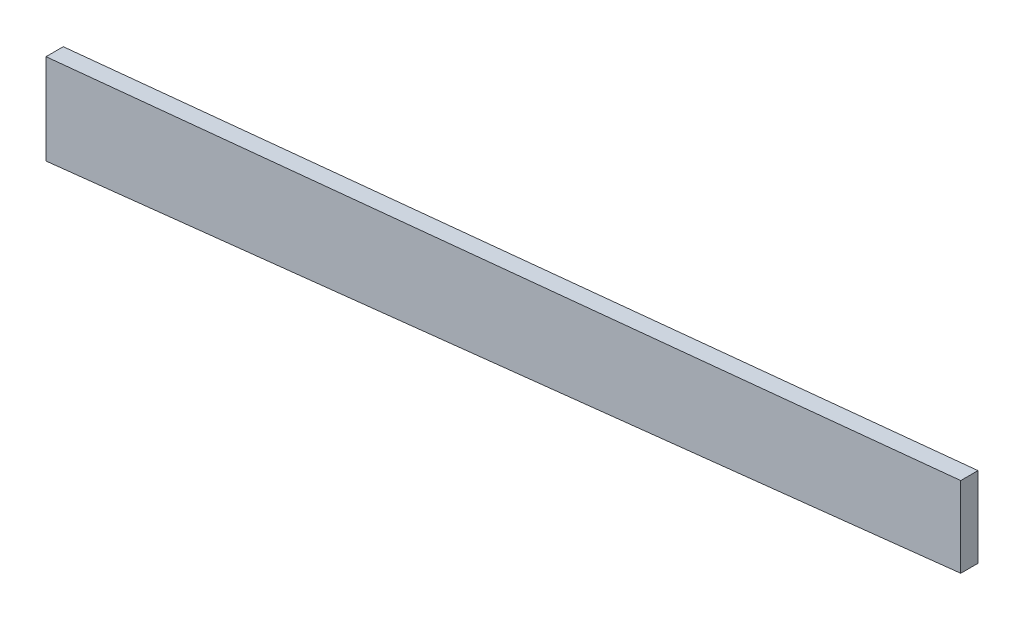
ISO-10303-21;
HEADER;
FILE_DESCRIPTION(('STEP AP214'),'2;1');
FILE_NAME('part.step','',(''),(''),'','','');
FILE_SCHEMA(('AUTOMOTIVE_DESIGN { 1 0 10303 214 1 1 1 1 }'));
ENDSEC;
DATA;
#1=APPLICATION_CONTEXT('core data for automotive mechanical design processes');
#2=APPLICATION_PROTOCOL_DEFINITION('international standard','automotive_design',2000,#1);
#3=PRODUCT_CONTEXT('',#1,'mechanical');
#4=PRODUCT('Part','Part','',(#3));
#5=PRODUCT_RELATED_PRODUCT_CATEGORY('part','',(#4));
#6=PRODUCT_DEFINITION_FORMATION('','',#4);
#7=PRODUCT_DEFINITION_CONTEXT('part definition',#1,'design');
#8=PRODUCT_DEFINITION('design','',#6,#7);
#9=PRODUCT_DEFINITION_SHAPE('','',#8);
#10=(LENGTH_UNIT() NAMED_UNIT(*) SI_UNIT(.MILLI.,.METRE.));
#11=(NAMED_UNIT(*) PLANE_ANGLE_UNIT() SI_UNIT($,.RADIAN.));
#12=(NAMED_UNIT(*) SI_UNIT($,.STERADIAN.) SOLID_ANGLE_UNIT());
#13=UNCERTAINTY_MEASURE_WITH_UNIT(LENGTH_MEASURE(1.E-05),#10,'distance_accuracy_value','');
#14=(GEOMETRIC_REPRESENTATION_CONTEXT(3) GLOBAL_UNCERTAINTY_ASSIGNED_CONTEXT((#13)) GLOBAL_UNIT_ASSIGNED_CONTEXT((#10,
#11,#12)) REPRESENTATION_CONTEXT('',''));
#15=CARTESIAN_POINT('',(0.,0.,0.));
#16=DIRECTION('',(0.,0.,1.));
#17=DIRECTION('',(1.,0.,0.));
#18=AXIS2_PLACEMENT_3D('',#15,#16,#17);
#19=CARTESIAN_POINT('',(-169.8625,0.,-3.175));
#20=DIRECTION('',(1.,0.,0.));
#21=DIRECTION('',(0.,0.,-1.));
#22=AXIS2_PLACEMENT_3D('',#19,#20,#21);
#23=PLANE('',#22);
#24=DIRECTION('',(0.,1.,0.));
#25=VECTOR('',#24,1.);
#26=CARTESIAN_POINT('',(-169.8625,0.,0.));
#27=LINE('',#26,#25);
#28=CARTESIAN_POINT('',(-169.8625,105.89060870458,0.));
#29=VERTEX_POINT('',#28);
#30=CARTESIAN_POINT('',(-169.8625,122.519845253023,0.));
#31=VERTEX_POINT('',#30);
#32=EDGE_CURVE('E102',#29,#31,#27,.T.);
#33=ORIENTED_EDGE('',*,*,#32,.T.);
#34=DIRECTION('',(0.,0.,1.));
#35=VECTOR('',#34,1.);
#36=CARTESIAN_POINT('',(-169.8625,122.519845253023,-3.175));
#37=LINE('',#36,#35);
#38=CARTESIAN_POINT('',(-169.8625,122.519845253023,-3.175));
#39=VERTEX_POINT('',#38);
#40=EDGE_CURVE('E11',#39,#31,#37,.T.);
#41=ORIENTED_EDGE('',*,*,#40,.F.);
#42=DIRECTION('',(0.,1.,0.));
#43=VECTOR('',#42,1.);
#44=CARTESIAN_POINT('',(-169.8625,0.,-3.175));
#45=LINE('',#44,#43);
#46=CARTESIAN_POINT('',(-169.8625,105.89060870458,-3.175));
#47=VERTEX_POINT('',#46);
#48=EDGE_CURVE('E57',#47,#39,#45,.T.);
#49=ORIENTED_EDGE('',*,*,#48,.F.);
#50=DIRECTION('',(0.,0.,1.));
#51=VECTOR('',#50,1.);
#52=CARTESIAN_POINT('',(-169.8625,105.89060870458,-3.175));
#53=LINE('',#52,#51);
#54=EDGE_CURVE('E42',#47,#29,#53,.T.);
#55=ORIENTED_EDGE('',*,*,#54,.T.);
#56=EDGE_LOOP('',(#33,#41,#49,#55));
#57=FACE_BOUND('',#56,.T.);
#58=ADVANCED_FACE('F39',(#57),#23,.F.);
#59=CARTESIAN_POINT('',(-13.6134957947172,137.940254406463,-3.175));
#60=DIRECTION('',(-0.0982141057246824,0.995165307593015,0.));
#61=DIRECTION('',(-0.995165307593016,-0.0982141057246824,0.));
#62=AXIS2_PLACEMENT_3D('',#59,#60,#61);
#63=PLANE('',#62);
#64=DIRECTION('',(-0.995165307593016,-0.0982141057246824,0.));
#65=VECTOR('',#64,1.);
#66=CARTESIAN_POINT('',(-13.6134957947172,137.940254406463,0.));
#67=LINE('',#66,#65);
#68=CARTESIAN_POINT('',(-1.5875,139.127114934473,0.));
#69=VERTEX_POINT('',#68);
#70=EDGE_CURVE('E98',#69,#31,#67,.T.);
#71=ORIENTED_EDGE('',*,*,#70,.F.);
#72=DIRECTION('',(0.,0.,1.));
#73=VECTOR('',#72,1.);
#74=CARTESIAN_POINT('',(-1.5875,139.127114934473,-3.175));
#75=LINE('',#74,#73);
#76=CARTESIAN_POINT('',(-1.5875,139.127114934473,-3.175));
#77=VERTEX_POINT('',#76);
#78=EDGE_CURVE('E48',#77,#69,#75,.T.);
#79=ORIENTED_EDGE('',*,*,#78,.F.);
#80=DIRECTION('',(-0.995165307593016,-0.0982141057246824,0.));
#81=VECTOR('',#80,1.);
#82=CARTESIAN_POINT('',(-13.6134957947172,137.940254406463,-3.175));
#83=LINE('',#82,#81);
#84=EDGE_CURVE('E87',#77,#39,#83,.T.);
#85=ORIENTED_EDGE('',*,*,#84,.T.);
#86=ORIENTED_EDGE('',*,*,#40,.T.);
#87=EDGE_LOOP('',(#71,#79,#85,#86));
#88=FACE_BOUND('',#87,.T.);
#89=ADVANCED_FACE('F112',(#88),#63,.T.);
#90=CARTESIAN_POINT('',(-1.5875,0.,-3.175));
#91=DIRECTION('',(-1.,0.,0.));
#92=DIRECTION('',(0.,-1.,0.));
#93=AXIS2_PLACEMENT_3D('',#90,#91,#92);
#94=PLANE('',#93);
#95=DIRECTION('',(0.,-1.,0.));
#96=VECTOR('',#95,1.);
#97=CARTESIAN_POINT('',(-1.5875,0.,0.));
#98=LINE('',#97,#96);
#99=CARTESIAN_POINT('',(-1.5875,124.350207240757,0.));
#100=VERTEX_POINT('',#99);
#101=EDGE_CURVE('E92',#69,#100,#98,.T.);
#102=ORIENTED_EDGE('',*,*,#101,.T.);
#103=DIRECTION('',(0.,0.,1.));
#104=VECTOR('',#103,1.);
#105=CARTESIAN_POINT('',(-1.5875,124.350207240757,-3.175));
#106=LINE('',#105,#104);
#107=CARTESIAN_POINT('',(-1.5875,124.350207240757,-3.175));
#108=VERTEX_POINT('',#107);
#109=EDGE_CURVE('E90',#108,#100,#106,.T.);
#110=ORIENTED_EDGE('',*,*,#109,.F.);
#111=DIRECTION('',(0.,-1.,0.));
#112=VECTOR('',#111,1.);
#113=CARTESIAN_POINT('',(-1.5875,0.,-3.175));
#114=LINE('',#113,#112);
#115=EDGE_CURVE('E84',#77,#108,#114,.T.);
#116=ORIENTED_EDGE('',*,*,#115,.F.);
#117=ORIENTED_EDGE('',*,*,#78,.T.);
#118=EDGE_LOOP('',(#102,#110,#116,#117));
#119=FACE_BOUND('',#118,.T.);
#120=ADVANCED_FACE('F91',(#119),#94,.F.);
#121=CARTESIAN_POINT('',(-13.4977662825132,123.043662988585,-3.175));
#122=DIRECTION('',(-0.109044842308986,0.994036831493586,0.));
#123=DIRECTION('',(-0.994036831493586,-0.109044842308986,0.));
#124=AXIS2_PLACEMENT_3D('',#121,#122,#123);
#125=PLANE('',#124);
#126=DIRECTION('',(-0.994036831493586,-0.109044842308986,0.));
#127=VECTOR('',#126,1.);
#128=CARTESIAN_POINT('',(-13.4977662825132,123.043662988585,0.));
#129=LINE('',#128,#127);
#130=EDGE_CURVE('E104',#100,#29,#129,.T.);
#131=ORIENTED_EDGE('',*,*,#130,.T.);
#132=ORIENTED_EDGE('',*,*,#54,.F.);
#133=DIRECTION('',(-0.994036831493586,-0.109044842308986,0.));
#134=VECTOR('',#133,1.);
#135=CARTESIAN_POINT('',(-13.4977662825132,123.043662988585,-3.175));
#136=LINE('',#135,#134);
#137=EDGE_CURVE('E82',#108,#47,#136,.T.);
#138=ORIENTED_EDGE('',*,*,#137,.F.);
#139=ORIENTED_EDGE('',*,*,#109,.T.);
#140=EDGE_LOOP('',(#131,#132,#138,#139));
#141=FACE_BOUND('',#140,.T.);
#142=ADVANCED_FACE('F95',(#141),#125,.F.);
#143=CARTESIAN_POINT('',(0.,0.,-3.175));
#144=DIRECTION('',(0.,0.,1.));
#145=DIRECTION('',(1.,0.,0.));
#146=AXIS2_PLACEMENT_3D('',#143,#144,#145);
#147=PLANE('',#146);
#148=ORIENTED_EDGE('',*,*,#48,.T.);
#149=ORIENTED_EDGE('',*,*,#84,.F.);
#150=ORIENTED_EDGE('',*,*,#115,.T.);
#151=ORIENTED_EDGE('',*,*,#137,.T.);
#152=EDGE_LOOP('',(#148,#149,#150,#151));
#153=FACE_BOUND('',#152,.T.);
#154=ADVANCED_FACE('F86',(#153),#147,.F.);
#155=CARTESIAN_POINT('',(0.,0.,0.));
#156=DIRECTION('',(0.,0.,1.));
#157=DIRECTION('',(1.,0.,0.));
#158=AXIS2_PLACEMENT_3D('',#155,#156,#157);
#159=PLANE('',#158);
#160=ORIENTED_EDGE('',*,*,#32,.F.);
#161=ORIENTED_EDGE('',*,*,#130,.F.);
#162=ORIENTED_EDGE('',*,*,#101,.F.);
#163=ORIENTED_EDGE('',*,*,#70,.T.);
#164=EDGE_LOOP('',(#160,#161,#162,#163));
#165=FACE_BOUND('',#164,.T.);
#166=ADVANCED_FACE('F111',(#165),#159,.T.);
#167=CLOSED_SHELL('',(#58,#89,#120,#142,#154,#166));
#168=MANIFOLD_SOLID_BREP('B2',#167);
#169=ADVANCED_BREP_SHAPE_REPRESENTATION('',(#18,#168),#14);
#170=SHAPE_DEFINITION_REPRESENTATION(#9,#169);
ENDSEC;
END-ISO-10303-21;
